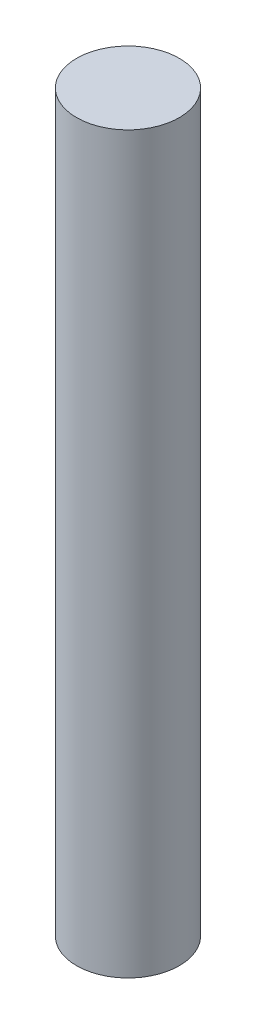
ISO-10303-21;
HEADER;
FILE_DESCRIPTION(('STEP AP214'),'2;1');
FILE_NAME('part.step','',(''),(''),'','','');
FILE_SCHEMA(('AUTOMOTIVE_DESIGN { 1 0 10303 214 1 1 1 1 }'));
ENDSEC;
DATA;
#1=APPLICATION_CONTEXT('core data for automotive mechanical design processes');
#2=APPLICATION_PROTOCOL_DEFINITION('international standard','automotive_design',2000,#1);
#3=PRODUCT_CONTEXT('',#1,'mechanical');
#4=PRODUCT('Part','Part','',(#3));
#5=PRODUCT_RELATED_PRODUCT_CATEGORY('part','',(#4));
#6=PRODUCT_DEFINITION_FORMATION('','',#4);
#7=PRODUCT_DEFINITION_CONTEXT('part definition',#1,'design');
#8=PRODUCT_DEFINITION('design','',#6,#7);
#9=PRODUCT_DEFINITION_SHAPE('','',#8);
#10=(LENGTH_UNIT() NAMED_UNIT(*) SI_UNIT(.MILLI.,.METRE.));
#11=(NAMED_UNIT(*) PLANE_ANGLE_UNIT() SI_UNIT($,.RADIAN.));
#12=(NAMED_UNIT(*) SI_UNIT($,.STERADIAN.) SOLID_ANGLE_UNIT());
#13=UNCERTAINTY_MEASURE_WITH_UNIT(LENGTH_MEASURE(1.E-05),#10,'distance_accuracy_value','');
#14=(GEOMETRIC_REPRESENTATION_CONTEXT(3) GLOBAL_UNCERTAINTY_ASSIGNED_CONTEXT((#13)) GLOBAL_UNIT_ASSIGNED_CONTEXT((#10,
#11,#12)) REPRESENTATION_CONTEXT('',''));
#15=CARTESIAN_POINT('',(0.,0.,0.));
#16=DIRECTION('',(0.,0.,1.));
#17=DIRECTION('',(1.,0.,0.));
#18=AXIS2_PLACEMENT_3D('',#15,#16,#17);
#19=CARTESIAN_POINT('',(0.,45.3898,0.));
#20=DIRECTION('',(0.,-1.,0.));
#21=DIRECTION('',(0.,0.,-1.));
#22=AXIS2_PLACEMENT_3D('',#19,#20,#21);
#23=CYLINDRICAL_SURFACE('',#22,3.175);
#24=CARTESIAN_POINT('',(0.,45.3898,0.));
#25=DIRECTION('',(0.,1.,0.));
#26=DIRECTION('',(0.,0.,1.));
#27=AXIS2_PLACEMENT_3D('',#24,#25,#26);
#28=CIRCLE('',#27,3.175);
#29=CARTESIAN_POINT('',(0.,45.3898,3.175));
#30=VERTEX_POINT('',#29);
#31=EDGE_CURVE('E10',#30,#30,#28,.T.);
#32=ORIENTED_EDGE('',*,*,#31,.F.);
#33=EDGE_LOOP('',(#32));
#34=FACE_BOUND('',#33,.T.);
#35=CARTESIAN_POINT('',(0.,0.,0.));
#36=DIRECTION('',(0.,1.,0.));
#37=DIRECTION('',(0.,0.,1.));
#38=AXIS2_PLACEMENT_3D('',#35,#36,#37);
#39=CIRCLE('',#38,3.175);
#40=CARTESIAN_POINT('',(0.,0.,3.175));
#41=VERTEX_POINT('',#40);
#42=EDGE_CURVE('E34',#41,#41,#39,.T.);
#43=ORIENTED_EDGE('',*,*,#42,.T.);
#44=EDGE_LOOP('',(#43));
#45=FACE_BOUND('',#44,.T.);
#46=ADVANCED_FACE('F31',(#34,#45),#23,.T.);
#47=CARTESIAN_POINT('',(0.,45.3898,0.));
#48=DIRECTION('',(0.,1.,0.));
#49=DIRECTION('',(0.,0.,1.));
#50=AXIS2_PLACEMENT_3D('',#47,#48,#49);
#51=PLANE('',#50);
#52=ORIENTED_EDGE('',*,*,#31,.T.);
#53=EDGE_LOOP('',(#52));
#54=FACE_BOUND('',#53,.T.);
#55=ADVANCED_FACE('F46',(#54),#51,.T.);
#56=CARTESIAN_POINT('',(0.,0.,0.));
#57=DIRECTION('',(0.,1.,0.));
#58=DIRECTION('',(0.,0.,1.));
#59=AXIS2_PLACEMENT_3D('',#56,#57,#58);
#60=PLANE('',#59);
#61=ORIENTED_EDGE('',*,*,#42,.F.);
#62=EDGE_LOOP('',(#61));
#63=FACE_BOUND('',#62,.T.);
#64=ADVANCED_FACE('F44',(#63),#60,.F.);
#65=CLOSED_SHELL('',(#46,#55,#64));
#66=MANIFOLD_SOLID_BREP('B2',#65);
#67=ADVANCED_BREP_SHAPE_REPRESENTATION('',(#18,#66),#14);
#68=SHAPE_DEFINITION_REPRESENTATION(#9,#67);
ENDSEC;
END-ISO-10303-21;
